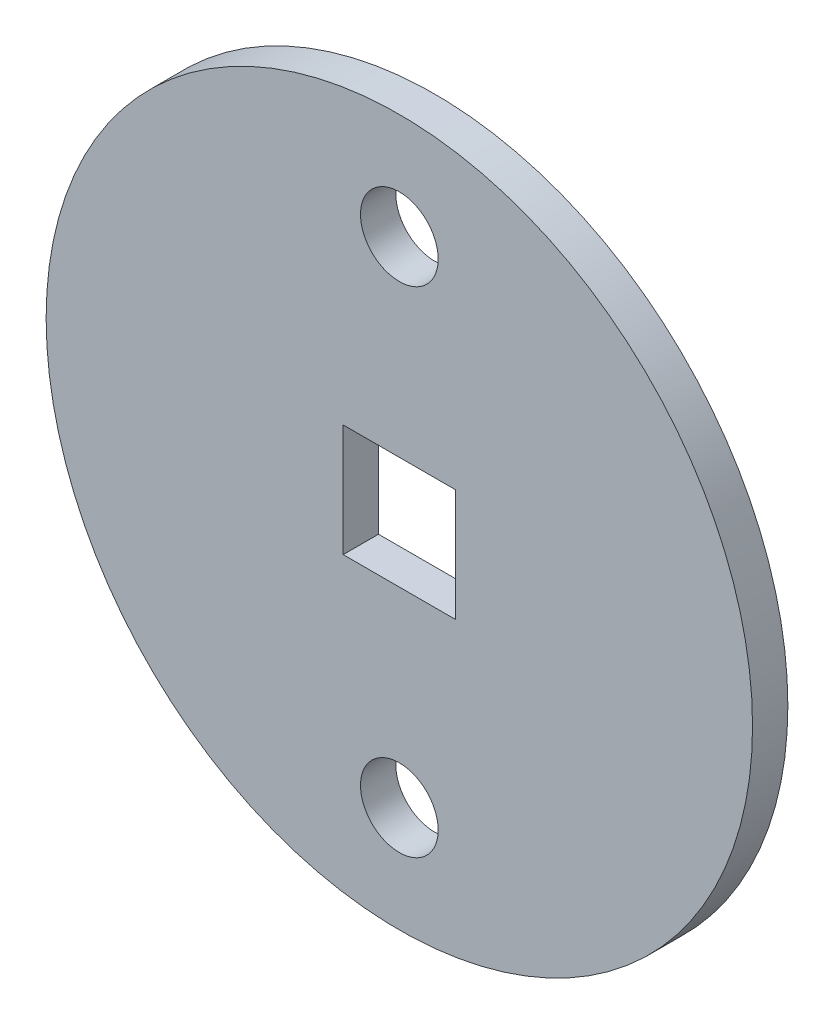
ISO-10303-21;
HEADER;
FILE_DESCRIPTION(('STEP AP214'),'2;1');
FILE_NAME('part.step','',(''),(''),'','','');
FILE_SCHEMA(('AUTOMOTIVE_DESIGN { 1 0 10303 214 1 1 1 1 }'));
ENDSEC;
DATA;
#1=APPLICATION_CONTEXT('core data for automotive mechanical design processes');
#2=APPLICATION_PROTOCOL_DEFINITION('international standard','automotive_design',2000,#1);
#3=PRODUCT_CONTEXT('',#1,'mechanical');
#4=PRODUCT('Part','Part','',(#3));
#5=PRODUCT_RELATED_PRODUCT_CATEGORY('part','',(#4));
#6=PRODUCT_DEFINITION_FORMATION('','',#4);
#7=PRODUCT_DEFINITION_CONTEXT('part definition',#1,'design');
#8=PRODUCT_DEFINITION('design','',#6,#7);
#9=PRODUCT_DEFINITION_SHAPE('','',#8);
#10=(LENGTH_UNIT() NAMED_UNIT(*) SI_UNIT(.MILLI.,.METRE.));
#11=(NAMED_UNIT(*) PLANE_ANGLE_UNIT() SI_UNIT($,.RADIAN.));
#12=(NAMED_UNIT(*) SI_UNIT($,.STERADIAN.) SOLID_ANGLE_UNIT());
#13=UNCERTAINTY_MEASURE_WITH_UNIT(LENGTH_MEASURE(1.E-05),#10,'distance_accuracy_value','');
#14=(GEOMETRIC_REPRESENTATION_CONTEXT(3) GLOBAL_UNCERTAINTY_ASSIGNED_CONTEXT((#13)) GLOBAL_UNIT_ASSIGNED_CONTEXT((#10,
#11,#12)) REPRESENTATION_CONTEXT('',''));
#15=CARTESIAN_POINT('',(0.,0.,0.));
#16=DIRECTION('',(0.,0.,1.));
#17=DIRECTION('',(1.,0.,0.));
#18=AXIS2_PLACEMENT_3D('',#15,#16,#17);
#19=CARTESIAN_POINT('',(0.,0.,-1.));
#20=DIRECTION('',(0.,0.,1.));
#21=DIRECTION('',(1.,0.,0.));
#22=AXIS2_PLACEMENT_3D('',#19,#20,#21);
#23=CYLINDRICAL_SURFACE('',#22,10.);
#24=CARTESIAN_POINT('',(0.,0.,-1.));
#25=DIRECTION('',(0.,0.,1.));
#26=DIRECTION('',(1.,0.,0.));
#27=AXIS2_PLACEMENT_3D('',#24,#25,#26);
#28=CIRCLE('',#27,10.);
#29=CARTESIAN_POINT('',(10.,0.,-1.));
#30=VERTEX_POINT('',#29);
#31=EDGE_CURVE('E11',#30,#30,#28,.T.);
#32=ORIENTED_EDGE('',*,*,#31,.T.);
#33=EDGE_LOOP('',(#32));
#34=FACE_BOUND('',#33,.T.);
#35=CARTESIAN_POINT('',(0.,0.,0.));
#36=DIRECTION('',(0.,0.,1.));
#37=DIRECTION('',(1.,0.,0.));
#38=AXIS2_PLACEMENT_3D('',#35,#36,#37);
#39=CIRCLE('',#38,10.);
#40=CARTESIAN_POINT('',(10.,0.,0.));
#41=VERTEX_POINT('',#40);
#42=EDGE_CURVE('E40',#41,#41,#39,.T.);
#43=ORIENTED_EDGE('',*,*,#42,.F.);
#44=EDGE_LOOP('',(#43));
#45=FACE_BOUND('',#44,.T.);
#46=ADVANCED_FACE('F37',(#34,#45),#23,.T.);
#47=CARTESIAN_POINT('',(0.,0.,-1.));
#48=DIRECTION('',(0.,0.,1.));
#49=DIRECTION('',(1.,0.,0.));
#50=AXIS2_PLACEMENT_3D('',#47,#48,#49);
#51=PLANE('',#50);
#52=DIRECTION('',(0.,-1.,0.));
#53=VECTOR('',#52,1.);
#54=CARTESIAN_POINT('',(-1.59,0.,-1.));
#55=LINE('',#54,#53);
#56=CARTESIAN_POINT('',(-1.59,1.59,-0.999999999999999));
#57=VERTEX_POINT('',#56);
#58=CARTESIAN_POINT('',(-1.59,-1.59,-0.999999999999999));
#59=VERTEX_POINT('',#58);
#60=EDGE_CURVE('E108',#57,#59,#55,.T.);
#61=ORIENTED_EDGE('',*,*,#60,.T.);
#62=DIRECTION('',(1.,0.,0.));
#63=VECTOR('',#62,1.);
#64=CARTESIAN_POINT('',(0.,-1.59,-1.));
#65=LINE('',#64,#63);
#66=CARTESIAN_POINT('',(1.59,-1.59,-0.999999999999999));
#67=VERTEX_POINT('',#66);
#68=EDGE_CURVE('E111',#59,#67,#65,.T.);
#69=ORIENTED_EDGE('',*,*,#68,.T.);
#70=DIRECTION('',(0.,1.,0.));
#71=VECTOR('',#70,1.);
#72=CARTESIAN_POINT('',(1.59,0.,-1.));
#73=LINE('',#72,#71);
#74=CARTESIAN_POINT('',(1.59,1.59,-1.));
#75=VERTEX_POINT('',#74);
#76=EDGE_CURVE('E102',#67,#75,#73,.T.);
#77=ORIENTED_EDGE('',*,*,#76,.T.);
#78=DIRECTION('',(-1.,0.,0.));
#79=VECTOR('',#78,1.);
#80=CARTESIAN_POINT('',(0.,1.59,-1.));
#81=LINE('',#80,#79);
#82=EDGE_CURVE('E83',#75,#57,#81,.T.);
#83=ORIENTED_EDGE('',*,*,#82,.T.);
#84=EDGE_LOOP('',(#61,#69,#77,#83));
#85=FACE_BOUND('',#84,.T.);
#86=CARTESIAN_POINT('',(0.,-7.,-1.));
#87=DIRECTION('',(0.,0.,1.));
#88=DIRECTION('',(1.,0.,0.));
#89=AXIS2_PLACEMENT_3D('',#86,#87,#88);
#90=CIRCLE('',#89,1.1);
#91=CARTESIAN_POINT('',(1.1,-7.,-1.));
#92=VERTEX_POINT('',#91);
#93=EDGE_CURVE('E115',#92,#92,#90,.T.);
#94=ORIENTED_EDGE('',*,*,#93,.T.);
#95=EDGE_LOOP('',(#94));
#96=FACE_BOUND('',#95,.T.);
#97=CARTESIAN_POINT('',(0.,7.,-1.));
#98=DIRECTION('',(0.,0.,1.));
#99=DIRECTION('',(1.,0.,0.));
#100=AXIS2_PLACEMENT_3D('',#97,#98,#99);
#101=CIRCLE('',#100,1.1);
#102=CARTESIAN_POINT('',(1.1,7.,-1.));
#103=VERTEX_POINT('',#102);
#104=EDGE_CURVE('E121',#103,#103,#101,.T.);
#105=ORIENTED_EDGE('',*,*,#104,.T.);
#106=EDGE_LOOP('',(#105));
#107=FACE_BOUND('',#106,.T.);
#108=ORIENTED_EDGE('',*,*,#31,.F.);
#109=EDGE_LOOP('',(#108));
#110=FACE_BOUND('',#109,.T.);
#111=ADVANCED_FACE('F131',(#85,#96,#107,#110),#51,.F.);
#112=CARTESIAN_POINT('',(0.,0.,0.));
#113=DIRECTION('',(0.,0.,1.));
#114=DIRECTION('',(1.,0.,0.));
#115=AXIS2_PLACEMENT_3D('',#112,#113,#114);
#116=PLANE('',#115);
#117=DIRECTION('',(1.,0.,0.));
#118=VECTOR('',#117,1.);
#119=CARTESIAN_POINT('',(-1.59,-1.59,0.));
#120=LINE('',#119,#118);
#121=CARTESIAN_POINT('',(-1.59,-1.59,0.));
#122=VERTEX_POINT('',#121);
#123=CARTESIAN_POINT('',(1.59,-1.59,0.));
#124=VERTEX_POINT('',#123);
#125=EDGE_CURVE('E59',#122,#124,#120,.T.);
#126=ORIENTED_EDGE('',*,*,#125,.F.);
#127=DIRECTION('',(0.,-1.,0.));
#128=VECTOR('',#127,1.);
#129=CARTESIAN_POINT('',(-1.59,1.59,0.));
#130=LINE('',#129,#128);
#131=CARTESIAN_POINT('',(-1.59,1.59,0.));
#132=VERTEX_POINT('',#131);
#133=EDGE_CURVE('E96',#132,#122,#130,.T.);
#134=ORIENTED_EDGE('',*,*,#133,.F.);
#135=DIRECTION('',(-1.,0.,0.));
#136=VECTOR('',#135,1.);
#137=CARTESIAN_POINT('',(1.59,1.59,0.));
#138=LINE('',#137,#136);
#139=CARTESIAN_POINT('',(1.59,1.59,0.));
#140=VERTEX_POINT('',#139);
#141=EDGE_CURVE('E80',#140,#132,#138,.T.);
#142=ORIENTED_EDGE('',*,*,#141,.F.);
#143=DIRECTION('',(0.,1.,0.));
#144=VECTOR('',#143,1.);
#145=CARTESIAN_POINT('',(1.59,0.,0.));
#146=LINE('',#145,#144);
#147=EDGE_CURVE('E88',#124,#140,#146,.T.);
#148=ORIENTED_EDGE('',*,*,#147,.F.);
#149=EDGE_LOOP('',(#126,#134,#142,#148));
#150=FACE_BOUND('',#149,.T.);
#151=CARTESIAN_POINT('',(0.,-7.,0.));
#152=DIRECTION('',(0.,0.,1.));
#153=DIRECTION('',(1.,0.,0.));
#154=AXIS2_PLACEMENT_3D('',#151,#152,#153);
#155=CIRCLE('',#154,1.1);
#156=CARTESIAN_POINT('',(1.1,-7.,0.));
#157=VERTEX_POINT('',#156);
#158=EDGE_CURVE('E114',#157,#157,#155,.T.);
#159=ORIENTED_EDGE('',*,*,#158,.F.);
#160=EDGE_LOOP('',(#159));
#161=FACE_BOUND('',#160,.T.);
#162=CARTESIAN_POINT('',(0.,7.,0.));
#163=DIRECTION('',(0.,0.,1.));
#164=DIRECTION('',(1.,0.,0.));
#165=AXIS2_PLACEMENT_3D('',#162,#163,#164);
#166=CIRCLE('',#165,1.1);
#167=CARTESIAN_POINT('',(1.1,7.,0.));
#168=VERTEX_POINT('',#167);
#169=EDGE_CURVE('E118',#168,#168,#166,.T.);
#170=ORIENTED_EDGE('',*,*,#169,.F.);
#171=EDGE_LOOP('',(#170));
#172=FACE_BOUND('',#171,.T.);
#173=ORIENTED_EDGE('',*,*,#42,.T.);
#174=EDGE_LOOP('',(#173));
#175=FACE_BOUND('',#174,.T.);
#176=ADVANCED_FACE('F93',(#150,#161,#172,#175),#116,.T.);
#177=CARTESIAN_POINT('',(0.,7.,-1.));
#178=DIRECTION('',(0.,0.,1.));
#179=DIRECTION('',(1.,0.,0.));
#180=AXIS2_PLACEMENT_3D('',#177,#178,#179);
#181=CYLINDRICAL_SURFACE('',#180,1.1);
#182=ORIENTED_EDGE('',*,*,#104,.F.);
#183=EDGE_LOOP('',(#182));
#184=FACE_BOUND('',#183,.T.);
#185=ORIENTED_EDGE('',*,*,#169,.T.);
#186=EDGE_LOOP('',(#185));
#187=FACE_BOUND('',#186,.T.);
#188=ADVANCED_FACE('F127',(#184,#187),#181,.F.);
#189=CARTESIAN_POINT('',(0.,-7.,-1.));
#190=DIRECTION('',(0.,0.,1.));
#191=DIRECTION('',(1.,0.,0.));
#192=AXIS2_PLACEMENT_3D('',#189,#190,#191);
#193=CYLINDRICAL_SURFACE('',#192,1.1);
#194=ORIENTED_EDGE('',*,*,#93,.F.);
#195=EDGE_LOOP('',(#194));
#196=FACE_BOUND('',#195,.T.);
#197=ORIENTED_EDGE('',*,*,#158,.T.);
#198=EDGE_LOOP('',(#197));
#199=FACE_BOUND('',#198,.T.);
#200=ADVANCED_FACE('F150',(#196,#199),#193,.F.);
#201=CARTESIAN_POINT('',(-1.59,-1.59,-10.));
#202=DIRECTION('',(0.,-1.,0.));
#203=DIRECTION('',(0.,0.,-1.));
#204=AXIS2_PLACEMENT_3D('',#201,#202,#203);
#205=PLANE('',#204);
#206=DIRECTION('',(0.,0.,1.));
#207=VECTOR('',#206,1.);
#208=CARTESIAN_POINT('',(-1.59,-1.59,-10.));
#209=LINE('',#208,#207);
#210=EDGE_CURVE('E103',#59,#122,#209,.T.);
#211=ORIENTED_EDGE('',*,*,#210,.T.);
#212=ORIENTED_EDGE('',*,*,#125,.T.);
#213=DIRECTION('',(0.,0.,1.));
#214=VECTOR('',#213,1.);
#215=CARTESIAN_POINT('',(1.59,-1.59,-10.));
#216=LINE('',#215,#214);
#217=EDGE_CURVE('E90',#67,#124,#216,.T.);
#218=ORIENTED_EDGE('',*,*,#217,.F.);
#219=ORIENTED_EDGE('',*,*,#68,.F.);
#220=EDGE_LOOP('',(#211,#212,#218,#219));
#221=FACE_BOUND('',#220,.T.);
#222=ADVANCED_FACE('F154',(#221),#205,.F.);
#223=CARTESIAN_POINT('',(-1.59,1.59,-10.));
#224=DIRECTION('',(-1.,0.,0.));
#225=DIRECTION('',(0.,0.,1.));
#226=AXIS2_PLACEMENT_3D('',#223,#224,#225);
#227=PLANE('',#226);
#228=DIRECTION('',(0.,0.,1.));
#229=VECTOR('',#228,1.);
#230=CARTESIAN_POINT('',(-1.59,1.59,-10.));
#231=LINE('',#230,#229);
#232=EDGE_CURVE('E85',#57,#132,#231,.T.);
#233=ORIENTED_EDGE('',*,*,#232,.T.);
#234=ORIENTED_EDGE('',*,*,#133,.T.);
#235=ORIENTED_EDGE('',*,*,#210,.F.);
#236=ORIENTED_EDGE('',*,*,#60,.F.);
#237=EDGE_LOOP('',(#233,#234,#235,#236));
#238=FACE_BOUND('',#237,.T.);
#239=ADVANCED_FACE('F160',(#238),#227,.F.);
#240=CARTESIAN_POINT('',(1.59,1.59,-10.));
#241=DIRECTION('',(0.,1.,0.));
#242=DIRECTION('',(0.,0.,1.));
#243=AXIS2_PLACEMENT_3D('',#240,#241,#242);
#244=PLANE('',#243);
#245=DIRECTION('',(0.,0.,1.));
#246=VECTOR('',#245,1.);
#247=CARTESIAN_POINT('',(1.59,1.59,-10.));
#248=LINE('',#247,#246);
#249=EDGE_CURVE('E51',#75,#140,#248,.T.);
#250=ORIENTED_EDGE('',*,*,#249,.T.);
#251=ORIENTED_EDGE('',*,*,#141,.T.);
#252=ORIENTED_EDGE('',*,*,#232,.F.);
#253=ORIENTED_EDGE('',*,*,#82,.F.);
#254=EDGE_LOOP('',(#250,#251,#252,#253));
#255=FACE_BOUND('',#254,.T.);
#256=ADVANCED_FACE('F77',(#255),#244,.F.);
#257=CARTESIAN_POINT('',(1.59,0.,-10.));
#258=DIRECTION('',(1.,0.,0.));
#259=DIRECTION('',(0.,0.,-1.));
#260=AXIS2_PLACEMENT_3D('',#257,#258,#259);
#261=PLANE('',#260);
#262=ORIENTED_EDGE('',*,*,#217,.T.);
#263=ORIENTED_EDGE('',*,*,#147,.T.);
#264=ORIENTED_EDGE('',*,*,#249,.F.);
#265=ORIENTED_EDGE('',*,*,#76,.F.);
#266=EDGE_LOOP('',(#262,#263,#264,#265));
#267=FACE_BOUND('',#266,.T.);
#268=ADVANCED_FACE('F89',(#267),#261,.F.);
#269=CLOSED_SHELL('',(#46,#111,#176,#188,#200,#222,#239,#256,#268));
#270=MANIFOLD_SOLID_BREP('B2',#269);
#271=ADVANCED_BREP_SHAPE_REPRESENTATION('',(#18,#270),#14);
#272=SHAPE_DEFINITION_REPRESENTATION(#9,#271);
ENDSEC;
END-ISO-10303-21;
